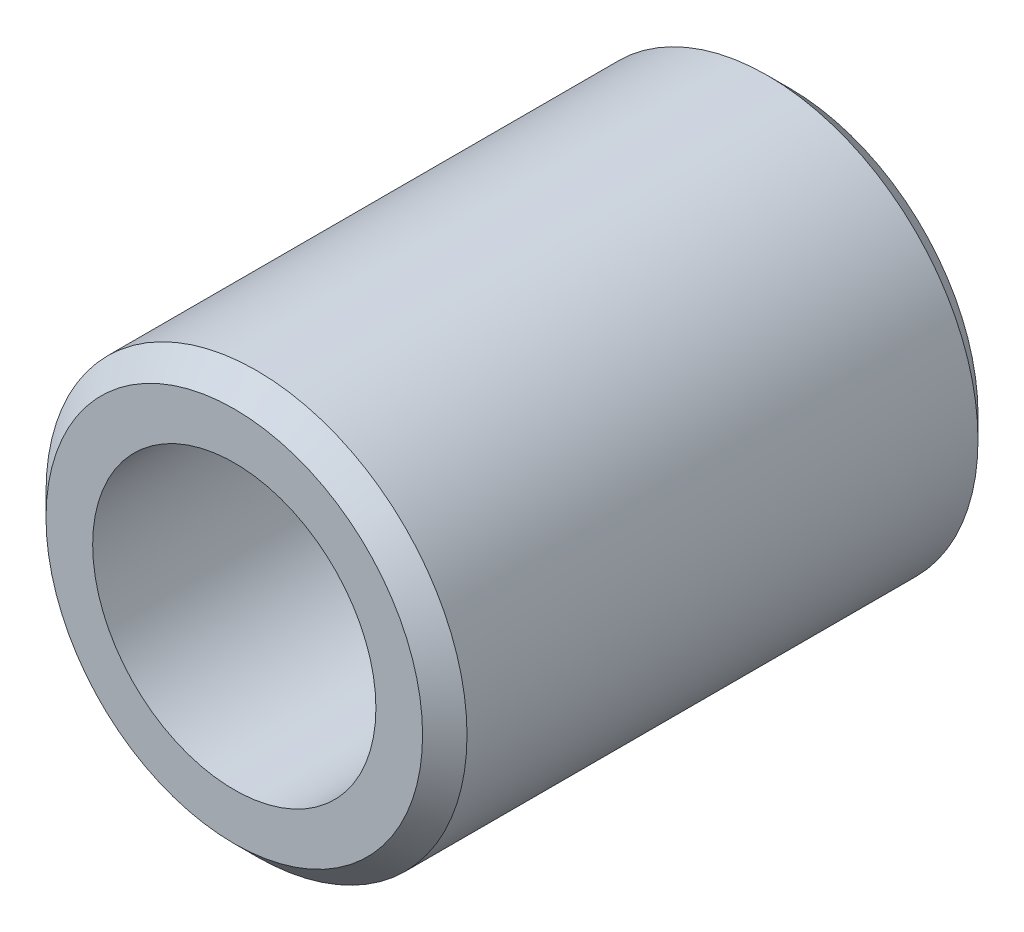
ISO-10303-21;
HEADER;
FILE_DESCRIPTION(('STEP AP214'),'2;1');
FILE_NAME('part.step','',(''),(''),'','','');
FILE_SCHEMA(('AUTOMOTIVE_DESIGN { 1 0 10303 214 1 1 1 1 }'));
ENDSEC;
DATA;
#1=APPLICATION_CONTEXT('core data for automotive mechanical design processes');
#2=APPLICATION_PROTOCOL_DEFINITION('international standard','automotive_design',2000,#1);
#3=PRODUCT_CONTEXT('',#1,'mechanical');
#4=PRODUCT('Part','Part','',(#3));
#5=PRODUCT_RELATED_PRODUCT_CATEGORY('part','',(#4));
#6=PRODUCT_DEFINITION_FORMATION('','',#4);
#7=PRODUCT_DEFINITION_CONTEXT('part definition',#1,'design');
#8=PRODUCT_DEFINITION('design','',#6,#7);
#9=PRODUCT_DEFINITION_SHAPE('','',#8);
#10=(LENGTH_UNIT() NAMED_UNIT(*) SI_UNIT(.MILLI.,.METRE.));
#11=(NAMED_UNIT(*) PLANE_ANGLE_UNIT() SI_UNIT($,.RADIAN.));
#12=(NAMED_UNIT(*) SI_UNIT($,.STERADIAN.) SOLID_ANGLE_UNIT());
#13=UNCERTAINTY_MEASURE_WITH_UNIT(LENGTH_MEASURE(1.E-05),#10,'distance_accuracy_value','');
#14=(GEOMETRIC_REPRESENTATION_CONTEXT(3) GLOBAL_UNCERTAINTY_ASSIGNED_CONTEXT((#13)) GLOBAL_UNIT_ASSIGNED_CONTEXT((#10,
#11,#12)) REPRESENTATION_CONTEXT('',''));
#15=CARTESIAN_POINT('',(0.,0.,0.));
#16=DIRECTION('',(0.,0.,1.));
#17=DIRECTION('',(1.,0.,0.));
#18=AXIS2_PLACEMENT_3D('',#15,#16,#17);
#19=CARTESIAN_POINT('',(0.,0.,2.921));
#20=DIRECTION('',(0.,0.,-1.));
#21=DIRECTION('',(-1.,0.,0.));
#22=AXIS2_PLACEMENT_3D('',#19,#20,#21);
#23=CONICAL_SURFACE('',#22,2.40665,0.785398163397449);
#24=CARTESIAN_POINT('',(0.,0.,3.175));
#25=DIRECTION('',(0.,0.,1.));
#26=DIRECTION('',(1.,0.,0.));
#27=AXIS2_PLACEMENT_3D('',#24,#25,#26);
#28=CIRCLE('',#27,2.15265);
#29=CARTESIAN_POINT('',(2.15265,0.,3.175));
#30=VERTEX_POINT('',#29);
#31=EDGE_CURVE('E54',#30,#30,#28,.T.);
#32=ORIENTED_EDGE('',*,*,#31,.F.);
#33=EDGE_LOOP('',(#32));
#34=FACE_BOUND('',#33,.T.);
#35=CARTESIAN_POINT('',(0.,0.,2.921));
#36=DIRECTION('',(0.,0.,1.));
#37=DIRECTION('',(1.,0.,0.));
#38=AXIS2_PLACEMENT_3D('',#35,#36,#37);
#39=CIRCLE('',#38,2.40665);
#40=CARTESIAN_POINT('',(2.40665,0.,2.921));
#41=VERTEX_POINT('',#40);
#42=EDGE_CURVE('E10',#41,#41,#39,.T.);
#43=ORIENTED_EDGE('',*,*,#42,.T.);
#44=EDGE_LOOP('',(#43));
#45=FACE_BOUND('',#44,.T.);
#46=ADVANCED_FACE('F32',(#34,#45),#23,.T.);
#47=CARTESIAN_POINT('',(0.,0.,-3.175));
#48=DIRECTION('',(0.,0.,1.));
#49=DIRECTION('',(1.,0.,0.));
#50=AXIS2_PLACEMENT_3D('',#47,#48,#49);
#51=CYLINDRICAL_SURFACE('',#50,2.40665);
#52=ORIENTED_EDGE('',*,*,#42,.F.);
#53=EDGE_LOOP('',(#52));
#54=FACE_BOUND('',#53,.T.);
#55=CARTESIAN_POINT('',(0.,0.,-2.921));
#56=DIRECTION('',(0.,0.,1.));
#57=DIRECTION('',(1.,0.,0.));
#58=AXIS2_PLACEMENT_3D('',#55,#56,#57);
#59=CIRCLE('',#58,2.40665);
#60=CARTESIAN_POINT('',(2.40665,0.,-2.921));
#61=VERTEX_POINT('',#60);
#62=EDGE_CURVE('E38',#61,#61,#59,.T.);
#63=ORIENTED_EDGE('',*,*,#62,.T.);
#64=EDGE_LOOP('',(#63));
#65=FACE_BOUND('',#64,.T.);
#66=ADVANCED_FACE('F61',(#54,#65),#51,.T.);
#67=CARTESIAN_POINT('',(0.,0.,-3.175));
#68=DIRECTION('',(0.,0.,1.));
#69=DIRECTION('',(1.,0.,0.));
#70=AXIS2_PLACEMENT_3D('',#67,#68,#69);
#71=CONICAL_SURFACE('',#70,2.15265,0.785398163397449);
#72=ORIENTED_EDGE('',*,*,#62,.F.);
#73=EDGE_LOOP('',(#72));
#74=FACE_BOUND('',#73,.T.);
#75=CARTESIAN_POINT('',(0.,0.,-3.175));
#76=DIRECTION('',(0.,0.,1.));
#77=DIRECTION('',(1.,0.,0.));
#78=AXIS2_PLACEMENT_3D('',#75,#76,#77);
#79=CIRCLE('',#78,2.15265);
#80=CARTESIAN_POINT('',(2.15265,0.,-3.175));
#81=VERTEX_POINT('',#80);
#82=EDGE_CURVE('E42',#81,#81,#79,.T.);
#83=ORIENTED_EDGE('',*,*,#82,.T.);
#84=EDGE_LOOP('',(#83));
#85=FACE_BOUND('',#84,.T.);
#86=ADVANCED_FACE('F65',(#74,#85),#71,.T.);
#87=CARTESIAN_POINT('',(0.,1.61925,-3.175));
#88=DIRECTION('',(0.,0.,1.));
#89=DIRECTION('',(1.,0.,0.));
#90=AXIS2_PLACEMENT_3D('',#87,#88,#89);
#91=PLANE('',#90);
#92=ORIENTED_EDGE('',*,*,#82,.F.);
#93=EDGE_LOOP('',(#92));
#94=FACE_BOUND('',#93,.T.);
#95=CARTESIAN_POINT('',(0.,0.,-3.175));
#96=DIRECTION('',(0.,0.,1.));
#97=DIRECTION('',(1.,0.,0.));
#98=AXIS2_PLACEMENT_3D('',#95,#96,#97);
#99=CIRCLE('',#98,1.61925);
#100=CARTESIAN_POINT('',(1.61925,0.,-3.175));
#101=VERTEX_POINT('',#100);
#102=EDGE_CURVE('E46',#101,#101,#99,.T.);
#103=ORIENTED_EDGE('',*,*,#102,.T.);
#104=EDGE_LOOP('',(#103));
#105=FACE_BOUND('',#104,.T.);
#106=ADVANCED_FACE('F70',(#94,#105),#91,.F.);
#107=CARTESIAN_POINT('',(0.,0.,-3.175));
#108=DIRECTION('',(0.,0.,1.));
#109=DIRECTION('',(1.,0.,0.));
#110=AXIS2_PLACEMENT_3D('',#107,#108,#109);
#111=CYLINDRICAL_SURFACE('',#110,1.61925);
#112=ORIENTED_EDGE('',*,*,#102,.F.);
#113=EDGE_LOOP('',(#112));
#114=FACE_BOUND('',#113,.T.);
#115=CARTESIAN_POINT('',(0.,0.,3.175));
#116=DIRECTION('',(0.,0.,1.));
#117=DIRECTION('',(1.,0.,0.));
#118=AXIS2_PLACEMENT_3D('',#115,#116,#117);
#119=CIRCLE('',#118,1.61925);
#120=CARTESIAN_POINT('',(1.61925,0.,3.175));
#121=VERTEX_POINT('',#120);
#122=EDGE_CURVE('E51',#121,#121,#119,.T.);
#123=ORIENTED_EDGE('',*,*,#122,.T.);
#124=EDGE_LOOP('',(#123));
#125=FACE_BOUND('',#124,.T.);
#126=ADVANCED_FACE('F76',(#114,#125),#111,.F.);
#127=CARTESIAN_POINT('',(0.,2.15265,3.175));
#128=DIRECTION('',(0.,0.,-1.));
#129=DIRECTION('',(-1.,0.,0.));
#130=AXIS2_PLACEMENT_3D('',#127,#128,#129);
#131=PLANE('',#130);
#132=ORIENTED_EDGE('',*,*,#122,.F.);
#133=EDGE_LOOP('',(#132));
#134=FACE_BOUND('',#133,.T.);
#135=ORIENTED_EDGE('',*,*,#31,.T.);
#136=EDGE_LOOP('',(#135));
#137=FACE_BOUND('',#136,.T.);
#138=ADVANCED_FACE('F58',(#134,#137),#131,.F.);
#139=CLOSED_SHELL('',(#46,#66,#86,#106,#126,#138));
#140=MANIFOLD_SOLID_BREP('B2',#139);
#141=ADVANCED_BREP_SHAPE_REPRESENTATION('',(#18,#140),#14);
#142=SHAPE_DEFINITION_REPRESENTATION(#9,#141);
ENDSEC;
END-ISO-10303-21;
